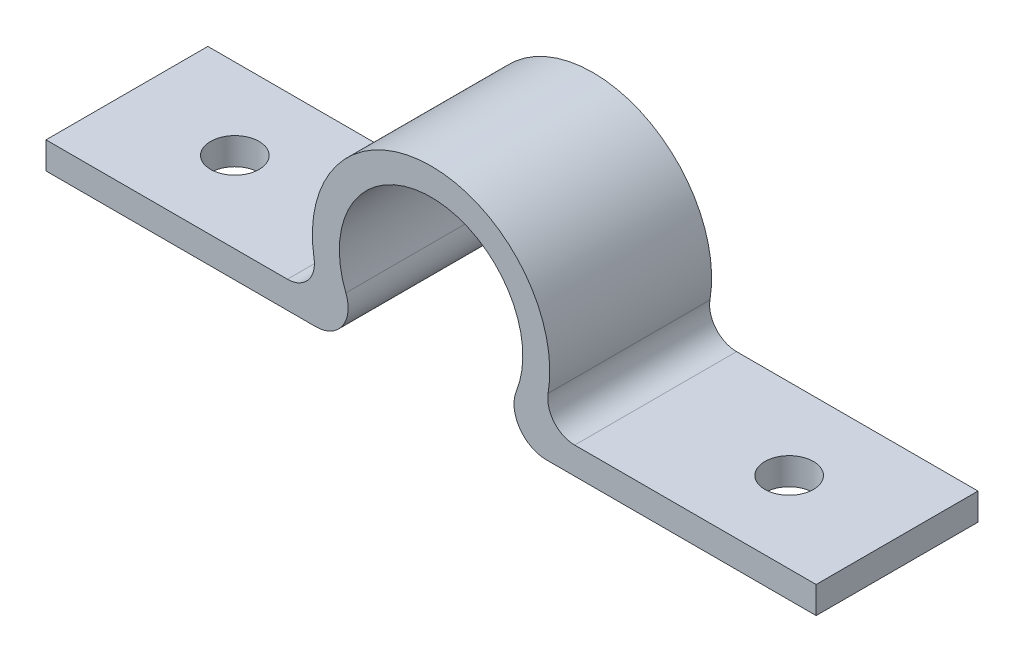
ISO-10303-21;
HEADER;
FILE_DESCRIPTION(('STEP AP214'),'2;1');
FILE_NAME('part.step','',(''),(''),'','','');
FILE_SCHEMA(('AUTOMOTIVE_DESIGN { 1 0 10303 214 1 1 1 1 }'));
ENDSEC;
DATA;
#1=APPLICATION_CONTEXT('core data for automotive mechanical design processes');
#2=APPLICATION_PROTOCOL_DEFINITION('international standard','automotive_design',2000,#1);
#3=PRODUCT_CONTEXT('',#1,'mechanical');
#4=PRODUCT('Part','Part','',(#3));
#5=PRODUCT_RELATED_PRODUCT_CATEGORY('part','',(#4));
#6=PRODUCT_DEFINITION_FORMATION('','',#4);
#7=PRODUCT_DEFINITION_CONTEXT('part definition',#1,'design');
#8=PRODUCT_DEFINITION('design','',#6,#7);
#9=PRODUCT_DEFINITION_SHAPE('','',#8);
#10=(LENGTH_UNIT() NAMED_UNIT(*) SI_UNIT(.MILLI.,.METRE.));
#11=(NAMED_UNIT(*) PLANE_ANGLE_UNIT() SI_UNIT($,.RADIAN.));
#12=(NAMED_UNIT(*) SI_UNIT($,.STERADIAN.) SOLID_ANGLE_UNIT());
#13=UNCERTAINTY_MEASURE_WITH_UNIT(LENGTH_MEASURE(1.E-05),#10,'distance_accuracy_value','');
#14=(GEOMETRIC_REPRESENTATION_CONTEXT(3) GLOBAL_UNCERTAINTY_ASSIGNED_CONTEXT((#13)) GLOBAL_UNIT_ASSIGNED_CONTEXT((#10,
#11,#12)) REPRESENTATION_CONTEXT('',''));
#15=CARTESIAN_POINT('',(0.,0.,0.));
#16=DIRECTION('',(0.,0.,1.));
#17=DIRECTION('',(1.,0.,0.));
#18=AXIS2_PLACEMENT_3D('',#15,#16,#17);
#19=CARTESIAN_POINT('',(0.,0.,30.));
#20=DIRECTION('',(0.,1.,0.));
#21=DIRECTION('',(0.,0.,1.));
#22=AXIS2_PLACEMENT_3D('',#19,#20,#21);
#23=PLANE('',#22);
#24=CARTESIAN_POINT('',(20.,0.,15.));
#25=DIRECTION('',(0.,1.,0.));
#26=DIRECTION('',(0.,0.,1.));
#27=AXIS2_PLACEMENT_3D('',#24,#25,#26);
#28=CIRCLE('',#27,4.49999999999999);
#29=CARTESIAN_POINT('',(20.,0.,19.5));
#30=VERTEX_POINT('',#29);
#31=EDGE_CURVE('E384',#30,#30,#28,.T.);
#32=ORIENTED_EDGE('',*,*,#31,.T.);
#33=EDGE_LOOP('',(#32));
#34=FACE_BOUND('',#33,.T.);
#35=DIRECTION('',(1.,0.,0.));
#36=VECTOR('',#35,1.);
#37=CARTESIAN_POINT('',(0.,0.,0.));
#38=LINE('',#37,#36);
#39=CARTESIAN_POINT('',(0.,0.,0.));
#40=VERTEX_POINT('',#39);
#41=CARTESIAN_POINT('',(50.,0.,0.));
#42=VERTEX_POINT('',#41);
#43=EDGE_CURVE('E146',#40,#42,#38,.T.);
#44=ORIENTED_EDGE('',*,*,#43,.T.);
#45=DIRECTION('',(0.,0.,-1.));
#46=VECTOR('',#45,1.);
#47=CARTESIAN_POINT('',(50.,0.,30.));
#48=LINE('',#47,#46);
#49=CARTESIAN_POINT('',(50.,0.,30.));
#50=VERTEX_POINT('',#49);
#51=EDGE_CURVE('E128',#50,#42,#48,.T.);
#52=ORIENTED_EDGE('',*,*,#51,.F.);
#53=DIRECTION('',(1.,0.,0.));
#54=VECTOR('',#53,1.);
#55=CARTESIAN_POINT('',(0.,0.,30.));
#56=LINE('',#55,#54);
#57=CARTESIAN_POINT('',(0.,0.,30.));
#58=VERTEX_POINT('',#57);
#59=EDGE_CURVE('E134',#58,#50,#56,.T.);
#60=ORIENTED_EDGE('',*,*,#59,.F.);
#61=DIRECTION('',(0.,0.,-1.));
#62=VECTOR('',#61,1.);
#63=CARTESIAN_POINT('',(0.,0.,30.));
#64=LINE('',#63,#62);
#65=EDGE_CURVE('E185',#58,#40,#64,.T.);
#66=ORIENTED_EDGE('',*,*,#65,.T.);
#67=EDGE_LOOP('',(#44,#52,#60,#66));
#68=FACE_BOUND('',#67,.T.);
#69=ADVANCED_FACE('F35',(#34,#68),#23,.F.);
#70=CARTESIAN_POINT('',(50.,6.,30.));
#71=DIRECTION('',(0.,0.,-1.));
#72=DIRECTION('',(-1.,0.,0.));
#73=AXIS2_PLACEMENT_3D('',#70,#71,#72);
#74=CYLINDRICAL_SURFACE('',#73,6.);
#75=CARTESIAN_POINT('',(50.,6.,0.));
#76=DIRECTION('',(0.,0.,1.));
#77=DIRECTION('',(1.,0.,0.));
#78=AXIS2_PLACEMENT_3D('',#75,#76,#77);
#79=CIRCLE('',#78,6.);
#80=CARTESIAN_POINT('',(55.5756655245265,8.21629284134725,0.));
#81=VERTEX_POINT('',#80);
#82=EDGE_CURVE('E192',#42,#81,#79,.T.);
#83=ORIENTED_EDGE('',*,*,#82,.T.);
#84=DIRECTION('',(0.,0.,-1.));
#85=VECTOR('',#84,1.);
#86=CARTESIAN_POINT('',(55.5756655245265,8.21629284134725,30.));
#87=LINE('',#86,#85);
#88=CARTESIAN_POINT('',(55.5756655245265,8.21629284134725,30.));
#89=VERTEX_POINT('',#88);
#90=EDGE_CURVE('E131',#89,#81,#87,.T.);
#91=ORIENTED_EDGE('',*,*,#90,.F.);
#92=CARTESIAN_POINT('',(50.,6.,30.));
#93=DIRECTION('',(0.,0.,1.));
#94=DIRECTION('',(1.,0.,0.));
#95=AXIS2_PLACEMENT_3D('',#92,#93,#94);
#96=CIRCLE('',#95,6.);
#97=EDGE_CURVE('E124',#50,#89,#96,.T.);
#98=ORIENTED_EDGE('',*,*,#97,.F.);
#99=ORIENTED_EDGE('',*,*,#51,.T.);
#100=EDGE_LOOP('',(#83,#91,#98,#99));
#101=FACE_BOUND('',#100,.T.);
#102=ADVANCED_FACE('F126',(#101),#74,.T.);
#103=CARTESIAN_POINT('',(71.3733845106848,14.4957892251645,30.));
#104=DIRECTION('',(0.,0.,-1.));
#105=DIRECTION('',(-1.,0.,0.));
#106=AXIS2_PLACEMENT_3D('',#103,#104,#105);
#107=CYLINDRICAL_SURFACE('',#106,17.);
#108=CARTESIAN_POINT('',(71.3733845106848,14.4957892251645,0.));
#109=DIRECTION('',(0.,0.,1.));
#110=DIRECTION('',(1.,0.,0.));
#111=AXIS2_PLACEMENT_3D('',#108,#109,#110);
#112=CIRCLE('',#111,17.);
#113=CARTESIAN_POINT('',(87.1711034968431,8.21629284134725,0.));
#114=VERTEX_POINT('',#113);
#115=EDGE_CURVE('E195',#81,#114,#112,.F.);
#116=ORIENTED_EDGE('',*,*,#115,.T.);
#117=DIRECTION('',(0.,0.,-1.));
#118=VECTOR('',#117,1.);
#119=CARTESIAN_POINT('',(87.1711034968431,8.21629284134725,30.));
#120=LINE('',#119,#118);
#121=CARTESIAN_POINT('',(87.1711034968431,8.21629284134725,30.));
#122=VERTEX_POINT('',#121);
#123=EDGE_CURVE('E151',#122,#114,#120,.T.);
#124=ORIENTED_EDGE('',*,*,#123,.F.);
#125=CARTESIAN_POINT('',(71.3733845106848,14.4957892251645,30.));
#126=DIRECTION('',(0.,0.,1.));
#127=DIRECTION('',(1.,0.,0.));
#128=AXIS2_PLACEMENT_3D('',#125,#126,#127);
#129=CIRCLE('',#128,17.);
#130=EDGE_CURVE('E133',#89,#122,#129,.F.);
#131=ORIENTED_EDGE('',*,*,#130,.F.);
#132=ORIENTED_EDGE('',*,*,#90,.T.);
#133=EDGE_LOOP('',(#116,#124,#131,#132));
#134=FACE_BOUND('',#133,.T.);
#135=ADVANCED_FACE('F266',(#134),#107,.F.);
#136=CARTESIAN_POINT('',(92.7467690213695,6.,30.));
#137=DIRECTION('',(0.,0.,-1.));
#138=DIRECTION('',(-1.,0.,0.));
#139=AXIS2_PLACEMENT_3D('',#136,#137,#138);
#140=CYLINDRICAL_SURFACE('',#139,6.00000000000001);
#141=CARTESIAN_POINT('',(92.7467690213695,6.,0.));
#142=DIRECTION('',(0.,0.,1.));
#143=DIRECTION('',(1.,0.,0.));
#144=AXIS2_PLACEMENT_3D('',#141,#142,#143);
#145=CIRCLE('',#144,6.00000000000001);
#146=CARTESIAN_POINT('',(92.7467690213695,0.,0.));
#147=VERTEX_POINT('',#146);
#148=EDGE_CURVE('E197',#114,#147,#145,.T.);
#149=ORIENTED_EDGE('',*,*,#148,.T.);
#150=DIRECTION('',(0.,0.,-1.));
#151=VECTOR('',#150,1.);
#152=CARTESIAN_POINT('',(92.7467690213695,0.,30.));
#153=LINE('',#152,#151);
#154=CARTESIAN_POINT('',(92.7467690213695,0.,30.));
#155=VERTEX_POINT('',#154);
#156=EDGE_CURVE('E215',#155,#147,#153,.T.);
#157=ORIENTED_EDGE('',*,*,#156,.F.);
#158=CARTESIAN_POINT('',(92.7467690213695,6.,30.));
#159=DIRECTION('',(0.,0.,1.));
#160=DIRECTION('',(1.,0.,0.));
#161=AXIS2_PLACEMENT_3D('',#158,#159,#160);
#162=CIRCLE('',#161,6.00000000000001);
#163=EDGE_CURVE('E224',#122,#155,#162,.T.);
#164=ORIENTED_EDGE('',*,*,#163,.F.);
#165=ORIENTED_EDGE('',*,*,#123,.T.);
#166=EDGE_LOOP('',(#149,#157,#164,#165));
#167=FACE_BOUND('',#166,.T.);
#168=ADVANCED_FACE('F222',(#167),#140,.T.);
#169=CARTESIAN_POINT('',(0.,0.,30.));
#170=DIRECTION('',(0.,1.,0.));
#171=DIRECTION('',(0.,0.,1.));
#172=AXIS2_PLACEMENT_3D('',#169,#170,#171);
#173=PLANE('',#172);
#174=CARTESIAN_POINT('',(122.74676902137,0.,15.));
#175=DIRECTION('',(0.,1.,0.));
#176=DIRECTION('',(0.,0.,1.));
#177=AXIS2_PLACEMENT_3D('',#174,#175,#176);
#178=CIRCLE('',#177,4.49999999999999);
#179=CARTESIAN_POINT('',(122.74676902137,0.,19.5));
#180=VERTEX_POINT('',#179);
#181=EDGE_CURVE('E193',#180,#180,#178,.T.);
#182=ORIENTED_EDGE('',*,*,#181,.T.);
#183=EDGE_LOOP('',(#182));
#184=FACE_BOUND('',#183,.T.);
#185=DIRECTION('',(1.,0.,0.));
#186=VECTOR('',#185,1.);
#187=CARTESIAN_POINT('',(0.,0.,0.));
#188=LINE('',#187,#186);
#189=CARTESIAN_POINT('',(142.74676902137,0.,0.));
#190=VERTEX_POINT('',#189);
#191=EDGE_CURVE('E199',#147,#190,#188,.T.);
#192=ORIENTED_EDGE('',*,*,#191,.T.);
#193=DIRECTION('',(0.,0.,-1.));
#194=VECTOR('',#193,1.);
#195=CARTESIAN_POINT('',(142.74676902137,0.,30.));
#196=LINE('',#195,#194);
#197=CARTESIAN_POINT('',(142.74676902137,0.,30.));
#198=VERTEX_POINT('',#197);
#199=EDGE_CURVE('E213',#198,#190,#196,.T.);
#200=ORIENTED_EDGE('',*,*,#199,.F.);
#201=DIRECTION('',(1.,0.,0.));
#202=VECTOR('',#201,1.);
#203=CARTESIAN_POINT('',(0.,0.,30.));
#204=LINE('',#203,#202);
#205=EDGE_CURVE('E234',#155,#198,#204,.T.);
#206=ORIENTED_EDGE('',*,*,#205,.F.);
#207=ORIENTED_EDGE('',*,*,#156,.T.);
#208=EDGE_LOOP('',(#192,#200,#206,#207));
#209=FACE_BOUND('',#208,.T.);
#210=ADVANCED_FACE('F231',(#184,#209),#173,.F.);
#211=CARTESIAN_POINT('',(142.74676902137,0.,30.));
#212=DIRECTION('',(1.,0.,0.));
#213=DIRECTION('',(0.,0.,-1.));
#214=AXIS2_PLACEMENT_3D('',#211,#212,#213);
#215=PLANE('',#214);
#216=DIRECTION('',(0.,-1.,0.));
#217=VECTOR('',#216,1.);
#218=CARTESIAN_POINT('',(142.74676902137,0.,0.));
#219=LINE('',#218,#217);
#220=CARTESIAN_POINT('',(142.74676902137,5.,0.));
#221=VERTEX_POINT('',#220);
#222=EDGE_CURVE('E202',#221,#190,#219,.T.);
#223=ORIENTED_EDGE('',*,*,#222,.F.);
#224=DIRECTION('',(0.,0.,-1.));
#225=VECTOR('',#224,1.);
#226=CARTESIAN_POINT('',(142.74676902137,5.,30.));
#227=LINE('',#226,#225);
#228=CARTESIAN_POINT('',(142.74676902137,5.,30.));
#229=VERTEX_POINT('',#228);
#230=EDGE_CURVE('E210',#229,#221,#227,.T.);
#231=ORIENTED_EDGE('',*,*,#230,.F.);
#232=DIRECTION('',(0.,-1.,0.));
#233=VECTOR('',#232,1.);
#234=CARTESIAN_POINT('',(142.74676902137,0.,30.));
#235=LINE('',#234,#233);
#236=EDGE_CURVE('E236',#229,#198,#235,.T.);
#237=ORIENTED_EDGE('',*,*,#236,.T.);
#238=ORIENTED_EDGE('',*,*,#199,.T.);
#239=EDGE_LOOP('',(#223,#231,#237,#238));
#240=FACE_BOUND('',#239,.T.);
#241=ADVANCED_FACE('F249',(#240),#215,.T.);
#242=CARTESIAN_POINT('',(0.,5.,30.));
#243=DIRECTION('',(0.,1.,0.));
#244=DIRECTION('',(-1.,0.,0.));
#245=AXIS2_PLACEMENT_3D('',#242,#243,#244);
#246=PLANE('',#245);
#247=CARTESIAN_POINT('',(122.74676902137,5.,15.));
#248=DIRECTION('',(0.,1.,0.));
#249=DIRECTION('',(0.,0.,1.));
#250=AXIS2_PLACEMENT_3D('',#247,#248,#249);
#251=CIRCLE('',#250,4.49999999999999);
#252=CARTESIAN_POINT('',(122.74676902137,5.,19.5));
#253=VERTEX_POINT('',#252);
#254=EDGE_CURVE('E381',#253,#253,#251,.T.);
#255=ORIENTED_EDGE('',*,*,#254,.F.);
#256=EDGE_LOOP('',(#255));
#257=FACE_BOUND('',#256,.T.);
#258=DIRECTION('',(1.,0.,0.));
#259=VECTOR('',#258,1.);
#260=CARTESIAN_POINT('',(0.,5.,0.));
#261=LINE('',#260,#259);
#262=CARTESIAN_POINT('',(97.9964549429789,5.,0.));
#263=VERTEX_POINT('',#262);
#264=EDGE_CURVE('E177',#263,#221,#261,.T.);
#265=ORIENTED_EDGE('',*,*,#264,.F.);
#266=DIRECTION('',(0.,0.,1.));
#267=VECTOR('',#266,1.);
#268=CARTESIAN_POINT('',(97.9964549429789,5.,30.));
#269=LINE('',#268,#267);
#270=CARTESIAN_POINT('',(97.9964549429789,5.,30.));
#271=VERTEX_POINT('',#270);
#272=EDGE_CURVE('E157',#263,#271,#269,.T.);
#273=ORIENTED_EDGE('',*,*,#272,.T.);
#274=DIRECTION('',(1.,0.,0.));
#275=VECTOR('',#274,1.);
#276=CARTESIAN_POINT('',(0.,5.,30.));
#277=LINE('',#276,#275);
#278=EDGE_CURVE('E187',#271,#229,#277,.T.);
#279=ORIENTED_EDGE('',*,*,#278,.T.);
#280=ORIENTED_EDGE('',*,*,#230,.T.);
#281=EDGE_LOOP('',(#265,#273,#279,#280));
#282=FACE_BOUND('',#281,.T.);
#283=ADVANCED_FACE('F245',(#257,#282),#246,.T.);
#284=CARTESIAN_POINT('',(71.3733845106848,14.4957892251645,30.));
#285=DIRECTION('',(0.,0.,-1.));
#286=DIRECTION('',(-1.,0.,0.));
#287=AXIS2_PLACEMENT_3D('',#284,#285,#286);
#288=CYLINDRICAL_SURFACE('',#287,22.);
#289=CARTESIAN_POINT('',(71.3733845106848,14.4957892251645,30.));
#290=DIRECTION('',(0.,0.,1.));
#291=DIRECTION('',(1.,0.,0.));
#292=AXIS2_PLACEMENT_3D('',#289,#290,#291);
#293=CIRCLE('',#292,22.);
#294=CARTESIAN_POINT('',(49.6805123065932,10.8325535602156,30.));
#295=VERTEX_POINT('',#294);
#296=CARTESIAN_POINT('',(93.0662567147763,10.8325535602156,30.));
#297=VERTEX_POINT('',#296);
#298=EDGE_CURVE('E183',#295,#297,#293,.F.);
#299=ORIENTED_EDGE('',*,*,#298,.T.);
#300=DIRECTION('',(0.,0.,-1.));
#301=VECTOR('',#300,1.);
#302=CARTESIAN_POINT('',(93.0662567147763,10.8325535602156,30.));
#303=LINE('',#302,#301);
#304=CARTESIAN_POINT('',(93.0662567147763,10.8325535602156,0.));
#305=VERTEX_POINT('',#304);
#306=EDGE_CURVE('E149',#297,#305,#303,.T.);
#307=ORIENTED_EDGE('',*,*,#306,.T.);
#308=CARTESIAN_POINT('',(71.3733845106848,14.4957892251645,0.));
#309=DIRECTION('',(0.,0.,1.));
#310=DIRECTION('',(1.,0.,0.));
#311=AXIS2_PLACEMENT_3D('',#308,#309,#310);
#312=CIRCLE('',#311,22.);
#313=CARTESIAN_POINT('',(49.6805123065932,10.8325535602156,0.));
#314=VERTEX_POINT('',#313);
#315=EDGE_CURVE('E169',#314,#305,#312,.F.);
#316=ORIENTED_EDGE('',*,*,#315,.F.);
#317=DIRECTION('',(0.,0.,-1.));
#318=VECTOR('',#317,1.);
#319=CARTESIAN_POINT('',(49.6805123065932,10.8325535602156,30.));
#320=LINE('',#319,#318);
#321=EDGE_CURVE('E147',#314,#295,#320,.F.);
#322=ORIENTED_EDGE('',*,*,#321,.T.);
#323=EDGE_LOOP('',(#299,#307,#316,#322));
#324=FACE_BOUND('',#323,.T.);
#325=ADVANCED_FACE('F175',(#324),#288,.T.);
#326=CARTESIAN_POINT('',(0.,5.,30.));
#327=DIRECTION('',(0.,1.,0.));
#328=DIRECTION('',(0.,0.,1.));
#329=AXIS2_PLACEMENT_3D('',#326,#327,#328);
#330=PLANE('',#329);
#331=CARTESIAN_POINT('',(20.,5.,15.));
#332=DIRECTION('',(0.,1.,0.));
#333=DIRECTION('',(0.,0.,1.));
#334=AXIS2_PLACEMENT_3D('',#331,#332,#333);
#335=CIRCLE('',#334,4.49999999999999);
#336=CARTESIAN_POINT('',(20.,5.,19.5));
#337=VERTEX_POINT('',#336);
#338=EDGE_CURVE('E386',#337,#337,#335,.T.);
#339=ORIENTED_EDGE('',*,*,#338,.F.);
#340=EDGE_LOOP('',(#339));
#341=FACE_BOUND('',#340,.T.);
#342=DIRECTION('',(1.,0.,0.));
#343=VECTOR('',#342,1.);
#344=CARTESIAN_POINT('',(0.,5.,30.));
#345=LINE('',#344,#343);
#346=CARTESIAN_POINT('',(0.,5.,30.));
#347=VERTEX_POINT('',#346);
#348=CARTESIAN_POINT('',(44.7503140783906,5.,30.));
#349=VERTEX_POINT('',#348);
#350=EDGE_CURVE('E181',#347,#349,#345,.T.);
#351=ORIENTED_EDGE('',*,*,#350,.T.);
#352=DIRECTION('',(0.,0.,1.));
#353=VECTOR('',#352,1.);
#354=CARTESIAN_POINT('',(44.7503140783906,5.,0.));
#355=LINE('',#354,#353);
#356=CARTESIAN_POINT('',(44.7503140783906,5.,0.));
#357=VERTEX_POINT('',#356);
#358=EDGE_CURVE('E159',#349,#357,#355,.F.);
#359=ORIENTED_EDGE('',*,*,#358,.T.);
#360=DIRECTION('',(1.,0.,0.));
#361=VECTOR('',#360,1.);
#362=CARTESIAN_POINT('',(0.,5.,0.));
#363=LINE('',#362,#361);
#364=CARTESIAN_POINT('',(0.,5.,0.));
#365=VERTEX_POINT('',#364);
#366=EDGE_CURVE('E172',#365,#357,#363,.T.);
#367=ORIENTED_EDGE('',*,*,#366,.F.);
#368=DIRECTION('',(0.,0.,-1.));
#369=VECTOR('',#368,1.);
#370=CARTESIAN_POINT('',(0.,5.,30.));
#371=LINE('',#370,#369);
#372=EDGE_CURVE('E182',#347,#365,#371,.T.);
#373=ORIENTED_EDGE('',*,*,#372,.F.);
#374=EDGE_LOOP('',(#351,#359,#367,#373));
#375=FACE_BOUND('',#374,.T.);
#376=ADVANCED_FACE('F180',(#341,#375),#330,.T.);
#377=CARTESIAN_POINT('',(0.,0.,30.));
#378=DIRECTION('',(1.,0.,0.));
#379=DIRECTION('',(0.,1.,0.));
#380=AXIS2_PLACEMENT_3D('',#377,#378,#379);
#381=PLANE('',#380);
#382=DIRECTION('',(0.,-1.,0.));
#383=VECTOR('',#382,1.);
#384=CARTESIAN_POINT('',(0.,0.,0.));
#385=LINE('',#384,#383);
#386=EDGE_CURVE('E143',#365,#40,#385,.T.);
#387=ORIENTED_EDGE('',*,*,#386,.T.);
#388=ORIENTED_EDGE('',*,*,#65,.F.);
#389=DIRECTION('',(0.,-1.,0.));
#390=VECTOR('',#389,1.);
#391=CARTESIAN_POINT('',(0.,0.,30.));
#392=LINE('',#391,#390);
#393=EDGE_CURVE('E139',#347,#58,#392,.T.);
#394=ORIENTED_EDGE('',*,*,#393,.F.);
#395=ORIENTED_EDGE('',*,*,#372,.T.);
#396=EDGE_LOOP('',(#387,#388,#394,#395));
#397=FACE_BOUND('',#396,.T.);
#398=ADVANCED_FACE('F282',(#397),#381,.F.);
#399=CARTESIAN_POINT('',(0.,0.,30.));
#400=DIRECTION('',(0.,0.,1.));
#401=DIRECTION('',(1.,0.,0.));
#402=AXIS2_PLACEMENT_3D('',#399,#400,#401);
#403=PLANE('',#402);
#404=ORIENTED_EDGE('',*,*,#59,.T.);
#405=ORIENTED_EDGE('',*,*,#97,.T.);
#406=ORIENTED_EDGE('',*,*,#130,.T.);
#407=ORIENTED_EDGE('',*,*,#163,.T.);
#408=ORIENTED_EDGE('',*,*,#205,.T.);
#409=ORIENTED_EDGE('',*,*,#236,.F.);
#410=ORIENTED_EDGE('',*,*,#278,.F.);
#411=CARTESIAN_POINT('',(97.9964549429789,10.,30.));
#412=DIRECTION('',(0.,0.,1.));
#413=DIRECTION('',(1.,0.,0.));
#414=AXIS2_PLACEMENT_3D('',#411,#412,#413);
#415=CIRCLE('',#414,5.);
#416=EDGE_CURVE('E163',#271,#297,#415,.F.);
#417=ORIENTED_EDGE('',*,*,#416,.T.);
#418=ORIENTED_EDGE('',*,*,#298,.F.);
#419=CARTESIAN_POINT('',(44.7503140783906,10.,30.));
#420=DIRECTION('',(0.,0.,1.));
#421=DIRECTION('',(1.,0.,0.));
#422=AXIS2_PLACEMENT_3D('',#419,#420,#421);
#423=CIRCLE('',#422,5.);
#424=EDGE_CURVE('E11',#295,#349,#423,.F.);
#425=ORIENTED_EDGE('',*,*,#424,.T.);
#426=ORIENTED_EDGE('',*,*,#350,.F.);
#427=ORIENTED_EDGE('',*,*,#393,.T.);
#428=EDGE_LOOP('',(#404,#405,#406,#407,#408,#409,#410,#417,#418,#425,#426,#427));
#429=FACE_BOUND('',#428,.T.);
#430=ADVANCED_FACE('F137',(#429),#403,.T.);
#431=CARTESIAN_POINT('',(0.,0.,0.));
#432=DIRECTION('',(0.,0.,1.));
#433=DIRECTION('',(1.,0.,0.));
#434=AXIS2_PLACEMENT_3D('',#431,#432,#433);
#435=PLANE('',#434);
#436=ORIENTED_EDGE('',*,*,#43,.F.);
#437=ORIENTED_EDGE('',*,*,#386,.F.);
#438=ORIENTED_EDGE('',*,*,#366,.T.);
#439=CARTESIAN_POINT('',(44.7503140783906,10.,0.));
#440=DIRECTION('',(0.,0.,1.));
#441=DIRECTION('',(1.,0.,0.));
#442=AXIS2_PLACEMENT_3D('',#439,#440,#441);
#443=CIRCLE('',#442,5.);
#444=EDGE_CURVE('E43',#357,#314,#443,.T.);
#445=ORIENTED_EDGE('',*,*,#444,.T.);
#446=ORIENTED_EDGE('',*,*,#315,.T.);
#447=CARTESIAN_POINT('',(97.9964549429789,10.,0.));
#448=DIRECTION('',(0.,0.,1.));
#449=DIRECTION('',(1.,0.,0.));
#450=AXIS2_PLACEMENT_3D('',#447,#448,#449);
#451=CIRCLE('',#450,5.);
#452=EDGE_CURVE('E161',#305,#263,#451,.T.);
#453=ORIENTED_EDGE('',*,*,#452,.T.);
#454=ORIENTED_EDGE('',*,*,#264,.T.);
#455=ORIENTED_EDGE('',*,*,#222,.T.);
#456=ORIENTED_EDGE('',*,*,#191,.F.);
#457=ORIENTED_EDGE('',*,*,#148,.F.);
#458=ORIENTED_EDGE('',*,*,#115,.F.);
#459=ORIENTED_EDGE('',*,*,#82,.F.);
#460=EDGE_LOOP('',(#436,#437,#438,#445,#446,#453,#454,#455,#456,#457,#458,#459));
#461=FACE_BOUND('',#460,.T.);
#462=ADVANCED_FACE('F168',(#461),#435,.F.);
#463=CARTESIAN_POINT('',(97.9964549429789,10.,30.));
#464=DIRECTION('',(0.,0.,-1.));
#465=DIRECTION('',(-1.,0.,0.));
#466=AXIS2_PLACEMENT_3D('',#463,#464,#465);
#467=CYLINDRICAL_SURFACE('',#466,5.);
#468=ORIENTED_EDGE('',*,*,#416,.F.);
#469=ORIENTED_EDGE('',*,*,#272,.F.);
#470=ORIENTED_EDGE('',*,*,#452,.F.);
#471=ORIENTED_EDGE('',*,*,#306,.F.);
#472=EDGE_LOOP('',(#468,#469,#470,#471));
#473=FACE_BOUND('',#472,.T.);
#474=ADVANCED_FACE('F270',(#473),#467,.F.);
#475=CARTESIAN_POINT('',(44.7503140783906,10.,30.));
#476=DIRECTION('',(0.,0.,-1.));
#477=DIRECTION('',(-1.,0.,0.));
#478=AXIS2_PLACEMENT_3D('',#475,#476,#477);
#479=CYLINDRICAL_SURFACE('',#478,5.);
#480=ORIENTED_EDGE('',*,*,#424,.F.);
#481=ORIENTED_EDGE('',*,*,#321,.F.);
#482=ORIENTED_EDGE('',*,*,#444,.F.);
#483=ORIENTED_EDGE('',*,*,#358,.F.);
#484=EDGE_LOOP('',(#480,#481,#482,#483));
#485=FACE_BOUND('',#484,.T.);
#486=ADVANCED_FACE('F37',(#485),#479,.F.);
#487=CARTESIAN_POINT('',(122.74676902137,5.,15.));
#488=DIRECTION('',(0.,1.,0.));
#489=DIRECTION('',(0.,0.,1.));
#490=AXIS2_PLACEMENT_3D('',#487,#488,#489);
#491=CYLINDRICAL_SURFACE('',#490,4.49999999999999);
#492=ORIENTED_EDGE('',*,*,#181,.F.);
#493=EDGE_LOOP('',(#492));
#494=FACE_BOUND('',#493,.T.);
#495=ORIENTED_EDGE('',*,*,#254,.T.);
#496=EDGE_LOOP('',(#495));
#497=FACE_BOUND('',#496,.T.);
#498=ADVANCED_FACE('F277',(#494,#497),#491,.F.);
#499=CARTESIAN_POINT('',(20.,5.,15.));
#500=DIRECTION('',(0.,1.,0.));
#501=DIRECTION('',(0.,0.,1.));
#502=AXIS2_PLACEMENT_3D('',#499,#500,#501);
#503=CYLINDRICAL_SURFACE('',#502,4.49999999999999);
#504=ORIENTED_EDGE('',*,*,#31,.F.);
#505=EDGE_LOOP('',(#504));
#506=FACE_BOUND('',#505,.T.);
#507=ORIENTED_EDGE('',*,*,#338,.T.);
#508=EDGE_LOOP('',(#507));
#509=FACE_BOUND('',#508,.T.);
#510=ADVANCED_FACE('F390',(#506,#509),#503,.F.);
#511=CLOSED_SHELL('',(#69,#102,#135,#168,#210,#241,#283,#325,#376,#398,#430,#462,#474,#486,#498,#510));
#512=MANIFOLD_SOLID_BREP('B2',#511);
#513=ADVANCED_BREP_SHAPE_REPRESENTATION('',(#18,#512),#14);
#514=SHAPE_DEFINITION_REPRESENTATION(#9,#513);
ENDSEC;
END-ISO-10303-21;
